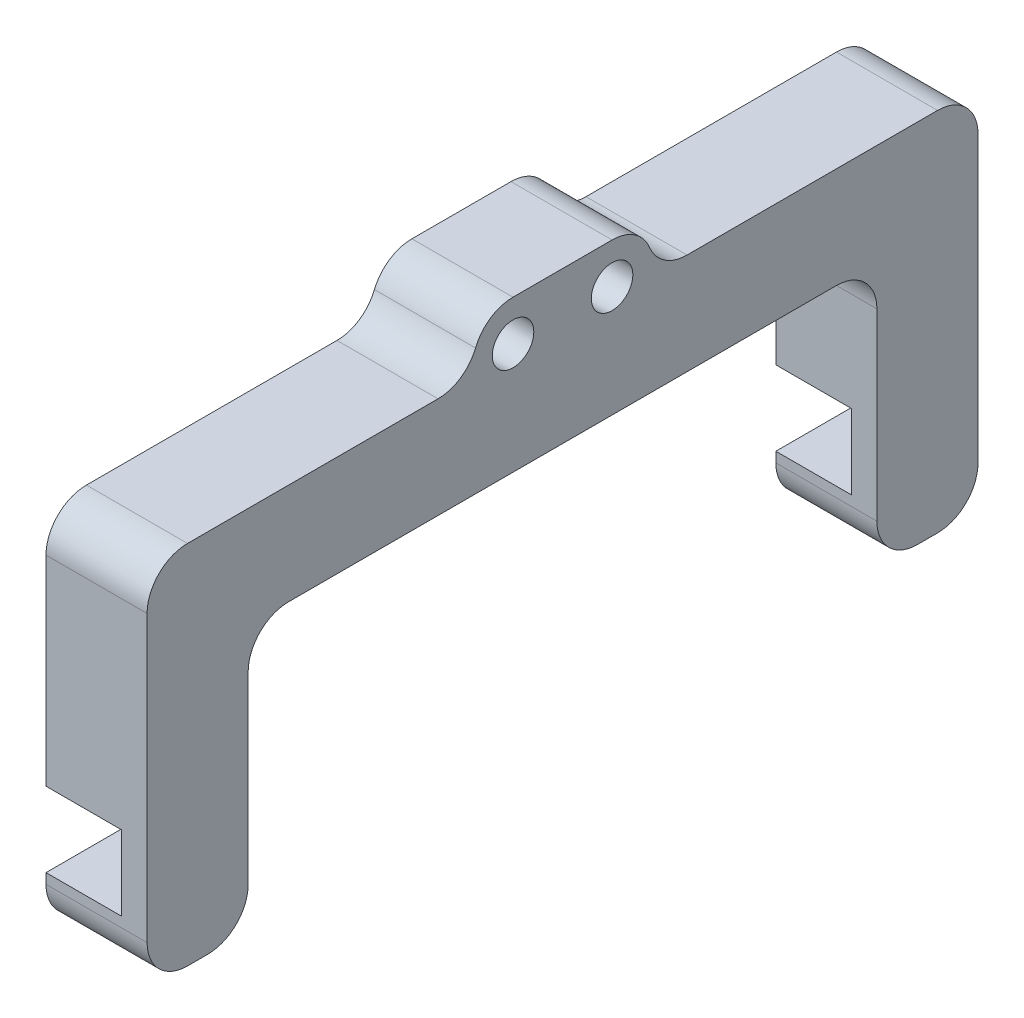
ISO-10303-21;
HEADER;
FILE_DESCRIPTION(('STEP AP214'),'2;1');
FILE_NAME('part.step','',(''),(''),'','','');
FILE_SCHEMA(('AUTOMOTIVE_DESIGN { 1 0 10303 214 1 1 1 1 }'));
ENDSEC;
DATA;
#1=APPLICATION_CONTEXT('core data for automotive mechanical design processes');
#2=APPLICATION_PROTOCOL_DEFINITION('international standard','automotive_design',2000,#1);
#3=PRODUCT_CONTEXT('',#1,'mechanical');
#4=PRODUCT('Part','Part','',(#3));
#5=PRODUCT_RELATED_PRODUCT_CATEGORY('part','',(#4));
#6=PRODUCT_DEFINITION_FORMATION('','',#4);
#7=PRODUCT_DEFINITION_CONTEXT('part definition',#1,'design');
#8=PRODUCT_DEFINITION('design','',#6,#7);
#9=PRODUCT_DEFINITION_SHAPE('','',#8);
#10=(LENGTH_UNIT() NAMED_UNIT(*) SI_UNIT(.MILLI.,.METRE.));
#11=(NAMED_UNIT(*) PLANE_ANGLE_UNIT() SI_UNIT($,.RADIAN.));
#12=(NAMED_UNIT(*) SI_UNIT($,.STERADIAN.) SOLID_ANGLE_UNIT());
#13=UNCERTAINTY_MEASURE_WITH_UNIT(LENGTH_MEASURE(1.E-05),#10,'distance_accuracy_value','');
#14=(GEOMETRIC_REPRESENTATION_CONTEXT(3) GLOBAL_UNCERTAINTY_ASSIGNED_CONTEXT((#13)) GLOBAL_UNIT_ASSIGNED_CONTEXT((#10,
#11,#12)) REPRESENTATION_CONTEXT('',''));
#15=CARTESIAN_POINT('',(0.,0.,0.));
#16=DIRECTION('',(0.,0.,1.));
#17=DIRECTION('',(1.,0.,0.));
#18=AXIS2_PLACEMENT_3D('',#15,#16,#17);
#19=CARTESIAN_POINT('',(-17.0423003142182,-28.8,-40.));
#20=DIRECTION('',(0.,-1.,0.));
#21=DIRECTION('',(0.,0.,-1.));
#22=AXIS2_PLACEMENT_3D('',#19,#20,#21);
#23=PLANE('',#22);
#24=DIRECTION('',(1.,0.,0.));
#25=VECTOR('',#24,1.);
#26=CARTESIAN_POINT('',(-17.0423003142182,-28.8,-50.));
#27=LINE('',#26,#25);
#28=CARTESIAN_POINT('',(0.,-28.8,-50.));
#29=VERTEX_POINT('',#28);
#30=CARTESIAN_POINT('',(7.47106781,-28.8,-50.));
#31=VERTEX_POINT('',#30);
#32=EDGE_CURVE('E335',#29,#31,#27,.T.);
#33=ORIENTED_EDGE('',*,*,#32,.T.);
#34=DIRECTION('',(0.,0.,-1.));
#35=VECTOR('',#34,1.);
#36=CARTESIAN_POINT('',(7.47106781,-28.8,-50.));
#37=LINE('',#36,#35);
#38=CARTESIAN_POINT('',(7.47106781,-28.8,-40.));
#39=VERTEX_POINT('',#38);
#40=EDGE_CURVE('E277',#39,#31,#37,.T.);
#41=ORIENTED_EDGE('',*,*,#40,.F.);
#42=DIRECTION('',(1.,0.,0.));
#43=VECTOR('',#42,1.);
#44=CARTESIAN_POINT('',(-17.0423003142182,-28.8,-40.));
#45=LINE('',#44,#43);
#46=CARTESIAN_POINT('',(0.,-28.8,-40.));
#47=VERTEX_POINT('',#46);
#48=EDGE_CURVE('E339',#47,#39,#45,.T.);
#49=ORIENTED_EDGE('',*,*,#48,.F.);
#50=DIRECTION('',(0.,0.,-1.));
#51=VECTOR('',#50,1.);
#52=CARTESIAN_POINT('',(0.,-28.8,-40.));
#53=LINE('',#52,#51);
#54=EDGE_CURVE('E331',#47,#29,#53,.T.);
#55=ORIENTED_EDGE('',*,*,#54,.T.);
#56=EDGE_LOOP('',(#33,#41,#49,#55));
#57=FACE_BOUND('',#56,.T.);
#58=ADVANCED_FACE('F38',(#57),#23,.T.);
#59=CARTESIAN_POINT('',(-17.0423003142182,-28.8,32.2));
#60=DIRECTION('',(0.,-1.,0.));
#61=DIRECTION('',(0.,0.,-1.));
#62=AXIS2_PLACEMENT_3D('',#59,#60,#61);
#63=PLANE('',#62);
#64=DIRECTION('',(1.,0.,0.));
#65=VECTOR('',#64,1.);
#66=CARTESIAN_POINT('',(-17.0423003142182,-28.8,22.2));
#67=LINE('',#66,#65);
#68=CARTESIAN_POINT('',(0.,-28.8,22.2));
#69=VERTEX_POINT('',#68);
#70=CARTESIAN_POINT('',(7.47106781,-28.8,22.2));
#71=VERTEX_POINT('',#70);
#72=EDGE_CURVE('E353',#69,#71,#67,.T.);
#73=ORIENTED_EDGE('',*,*,#72,.T.);
#74=DIRECTION('',(0.,0.,1.));
#75=VECTOR('',#74,1.);
#76=CARTESIAN_POINT('',(7.47106781,-28.8,32.2));
#77=LINE('',#76,#75);
#78=CARTESIAN_POINT('',(7.47106781,-28.8,32.2));
#79=VERTEX_POINT('',#78);
#80=EDGE_CURVE('E324',#71,#79,#77,.T.);
#81=ORIENTED_EDGE('',*,*,#80,.T.);
#82=DIRECTION('',(1.,0.,0.));
#83=VECTOR('',#82,1.);
#84=CARTESIAN_POINT('',(-17.0423003142182,-28.8,32.2));
#85=LINE('',#84,#83);
#86=CARTESIAN_POINT('',(0.,-28.8,32.2));
#87=VERTEX_POINT('',#86);
#88=EDGE_CURVE('E358',#87,#79,#85,.T.);
#89=ORIENTED_EDGE('',*,*,#88,.F.);
#90=DIRECTION('',(0.,0.,-1.));
#91=VECTOR('',#90,1.);
#92=CARTESIAN_POINT('',(0.,-28.8,32.2));
#93=LINE('',#92,#91);
#94=EDGE_CURVE('E349',#87,#69,#93,.T.);
#95=ORIENTED_EDGE('',*,*,#94,.T.);
#96=EDGE_LOOP('',(#73,#81,#89,#95));
#97=FACE_BOUND('',#96,.T.);
#98=ADVANCED_FACE('F635',(#97),#63,.T.);
#99=CARTESIAN_POINT('',(10.,-15.,32.2));
#100=DIRECTION('',(0.,1.,0.));
#101=DIRECTION('',(0.,0.,1.));
#102=AXIS2_PLACEMENT_3D('',#99,#100,#101);
#103=PLANE('',#102);
#104=DIRECTION('',(0.,0.,-1.));
#105=VECTOR('',#104,1.);
#106=CARTESIAN_POINT('',(0.,-15.,32.2));
#107=LINE('',#106,#105);
#108=CARTESIAN_POINT('',(0.,-15.,18.2));
#109=VERTEX_POINT('',#108);
#110=CARTESIAN_POINT('',(0.,-15.,-36.));
#111=VERTEX_POINT('',#110);
#112=EDGE_CURVE('E411',#109,#111,#107,.T.);
#113=ORIENTED_EDGE('',*,*,#112,.T.);
#114=DIRECTION('',(1.,0.,0.));
#115=VECTOR('',#114,1.);
#116=CARTESIAN_POINT('',(10.,-15.,-36.));
#117=LINE('',#116,#115);
#118=CARTESIAN_POINT('',(10.,-15.,-36.));
#119=VERTEX_POINT('',#118);
#120=EDGE_CURVE('E490',#111,#119,#117,.T.);
#121=ORIENTED_EDGE('',*,*,#120,.T.);
#122=DIRECTION('',(0.,0.,-1.));
#123=VECTOR('',#122,1.);
#124=CARTESIAN_POINT('',(10.,-15.,32.2));
#125=LINE('',#124,#123);
#126=CARTESIAN_POINT('',(10.,-15.,18.2));
#127=VERTEX_POINT('',#126);
#128=EDGE_CURVE('E389',#127,#119,#125,.T.);
#129=ORIENTED_EDGE('',*,*,#128,.F.);
#130=DIRECTION('',(1.,0.,0.));
#131=VECTOR('',#130,1.);
#132=CARTESIAN_POINT('',(10.,-15.,18.2));
#133=LINE('',#132,#131);
#134=EDGE_CURVE('E487',#127,#109,#133,.F.);
#135=ORIENTED_EDGE('',*,*,#134,.T.);
#136=EDGE_LOOP('',(#113,#121,#129,#135));
#137=FACE_BOUND('',#136,.T.);
#138=ADVANCED_FACE('F590',(#137),#103,.F.);
#139=CARTESIAN_POINT('',(10.,-5.,0.));
#140=DIRECTION('',(0.,-1.,0.));
#141=DIRECTION('',(0.,0.,-1.));
#142=AXIS2_PLACEMENT_3D('',#139,#140,#141);
#143=PLANE('',#142);
#144=DIRECTION('',(0.,0.,1.));
#145=VECTOR('',#144,1.);
#146=CARTESIAN_POINT('',(10.,-5.,0.));
#147=LINE('',#146,#145);
#148=CARTESIAN_POINT('',(10.,-5.,3.41619848709566));
#149=VERTEX_POINT('',#148);
#150=CARTESIAN_POINT('',(10.,-5.,28.2));
#151=VERTEX_POINT('',#150);
#152=EDGE_CURVE('E381',#149,#151,#147,.T.);
#153=ORIENTED_EDGE('',*,*,#152,.F.);
#154=DIRECTION('',(-1.,0.,0.));
#155=VECTOR('',#154,1.);
#156=CARTESIAN_POINT('',(10.,-5.,3.41619848709566));
#157=LINE('',#156,#155);
#158=CARTESIAN_POINT('',(0.,-5.,3.41619848709566));
#159=VERTEX_POINT('',#158);
#160=EDGE_CURVE('E556',#149,#159,#157,.T.);
#161=ORIENTED_EDGE('',*,*,#160,.T.);
#162=DIRECTION('',(0.,0.,1.));
#163=VECTOR('',#162,1.);
#164=CARTESIAN_POINT('',(0.,-5.,0.));
#165=LINE('',#164,#163);
#166=CARTESIAN_POINT('',(0.,-5.,28.2));
#167=VERTEX_POINT('',#166);
#168=EDGE_CURVE('E369',#159,#167,#165,.T.);
#169=ORIENTED_EDGE('',*,*,#168,.T.);
#170=DIRECTION('',(-1.,0.,0.));
#171=VECTOR('',#170,1.);
#172=CARTESIAN_POINT('',(10.,-5.,28.2));
#173=LINE('',#172,#171);
#174=EDGE_CURVE('E533',#167,#151,#173,.F.);
#175=ORIENTED_EDGE('',*,*,#174,.T.);
#176=EDGE_LOOP('',(#153,#161,#169,#175));
#177=FACE_BOUND('',#176,.T.);
#178=ADVANCED_FACE('F694',(#177),#143,.F.);
#179=CARTESIAN_POINT('',(10.,-5.,32.2));
#180=DIRECTION('',(0.,0.,-1.));
#181=DIRECTION('',(-1.,0.,0.));
#182=AXIS2_PLACEMENT_3D('',#179,#180,#181);
#183=PLANE('',#182);
#184=DIRECTION('',(0.,-1.,0.));
#185=VECTOR('',#184,1.);
#186=CARTESIAN_POINT('',(0.,-36.2,32.2));
#187=LINE('',#186,#185);
#188=CARTESIAN_POINT('',(0.,-36.2,32.2));
#189=VERTEX_POINT('',#188);
#190=CARTESIAN_POINT('',(0.,-37.2,32.2));
#191=VERTEX_POINT('',#190);
#192=EDGE_CURVE('E294',#189,#191,#187,.T.);
#193=ORIENTED_EDGE('',*,*,#192,.T.);
#194=DIRECTION('',(1.,0.,0.));
#195=VECTOR('',#194,1.);
#196=CARTESIAN_POINT('',(10.,-37.2,32.2));
#197=LINE('',#196,#195);
#198=CARTESIAN_POINT('',(10.,-37.2,32.2));
#199=VERTEX_POINT('',#198);
#200=EDGE_CURVE('E518',#191,#199,#197,.T.);
#201=ORIENTED_EDGE('',*,*,#200,.T.);
#202=DIRECTION('',(0.,-1.,0.));
#203=VECTOR('',#202,1.);
#204=CARTESIAN_POINT('',(10.,-5.,32.2));
#205=LINE('',#204,#203);
#206=CARTESIAN_POINT('',(10.,-9.00000000000001,32.2));
#207=VERTEX_POINT('',#206);
#208=EDGE_CURVE('E384',#207,#199,#205,.T.);
#209=ORIENTED_EDGE('',*,*,#208,.F.);
#210=DIRECTION('',(-1.,0.,0.));
#211=VECTOR('',#210,1.);
#212=CARTESIAN_POINT('',(10.,-9.00000000000001,32.2));
#213=LINE('',#212,#211);
#214=CARTESIAN_POINT('',(0.,-9.00000000000001,32.2));
#215=VERTEX_POINT('',#214);
#216=EDGE_CURVE('E514',#207,#215,#213,.T.);
#217=ORIENTED_EDGE('',*,*,#216,.T.);
#218=DIRECTION('',(0.,-1.,0.));
#219=VECTOR('',#218,1.);
#220=CARTESIAN_POINT('',(0.,-5.,32.2));
#221=LINE('',#220,#219);
#222=EDGE_CURVE('E408',#215,#87,#221,.T.);
#223=ORIENTED_EDGE('',*,*,#222,.T.);
#224=ORIENTED_EDGE('',*,*,#88,.T.);
#225=DIRECTION('',(0.,-1.,0.));
#226=VECTOR('',#225,1.);
#227=CARTESIAN_POINT('',(7.47106781,-28.8,32.2));
#228=LINE('',#227,#226);
#229=CARTESIAN_POINT('',(7.47106781,-36.2,32.2));
#230=VERTEX_POINT('',#229);
#231=EDGE_CURVE('E298',#79,#230,#228,.T.);
#232=ORIENTED_EDGE('',*,*,#231,.T.);
#233=DIRECTION('',(1.,0.,0.));
#234=VECTOR('',#233,1.);
#235=CARTESIAN_POINT('',(-11.1803398874989,-36.2,32.2));
#236=LINE('',#235,#234);
#237=EDGE_CURVE('E299',#189,#230,#236,.T.);
#238=ORIENTED_EDGE('',*,*,#237,.F.);
#239=EDGE_LOOP('',(#193,#201,#209,#217,#223,#224,#232,#238));
#240=FACE_BOUND('',#239,.T.);
#241=ADVANCED_FACE('F623',(#240),#183,.F.);
#242=CARTESIAN_POINT('',(10.,-15.,-50.));
#243=DIRECTION('',(0.,0.,1.));
#244=DIRECTION('',(1.,0.,0.));
#245=AXIS2_PLACEMENT_3D('',#242,#243,#244);
#246=PLANE('',#245);
#247=DIRECTION('',(0.,1.,0.));
#248=VECTOR('',#247,1.);
#249=CARTESIAN_POINT('',(10.,-15.,-50.));
#250=LINE('',#249,#248);
#251=CARTESIAN_POINT('',(10.,-37.2,-50.));
#252=VERTEX_POINT('',#251);
#253=CARTESIAN_POINT('',(10.,-9.,-50.));
#254=VERTEX_POINT('',#253);
#255=EDGE_CURVE('E393',#252,#254,#250,.T.);
#256=ORIENTED_EDGE('',*,*,#255,.F.);
#257=DIRECTION('',(1.,0.,0.));
#258=VECTOR('',#257,1.);
#259=CARTESIAN_POINT('',(10.,-37.2,-50.));
#260=LINE('',#259,#258);
#261=CARTESIAN_POINT('',(0.,-37.2,-50.));
#262=VERTEX_POINT('',#261);
#263=EDGE_CURVE('E473',#252,#262,#260,.F.);
#264=ORIENTED_EDGE('',*,*,#263,.T.);
#265=DIRECTION('',(0.,-1.,0.));
#266=VECTOR('',#265,1.);
#267=CARTESIAN_POINT('',(0.,-36.2,-50.));
#268=LINE('',#267,#266);
#269=CARTESIAN_POINT('',(0.,-36.2,-50.));
#270=VERTEX_POINT('',#269);
#271=EDGE_CURVE('E266',#270,#262,#268,.T.);
#272=ORIENTED_EDGE('',*,*,#271,.F.);
#273=DIRECTION('',(1.,0.,0.));
#274=VECTOR('',#273,1.);
#275=CARTESIAN_POINT('',(-11.1803398874989,-36.2,-50.));
#276=LINE('',#275,#274);
#277=CARTESIAN_POINT('',(7.47106781,-36.2,-50.));
#278=VERTEX_POINT('',#277);
#279=EDGE_CURVE('E263',#270,#278,#276,.T.);
#280=ORIENTED_EDGE('',*,*,#279,.T.);
#281=DIRECTION('',(0.,-1.,0.));
#282=VECTOR('',#281,1.);
#283=CARTESIAN_POINT('',(7.47106781,-28.8,-50.));
#284=LINE('',#283,#282);
#285=EDGE_CURVE('E248',#31,#278,#284,.T.);
#286=ORIENTED_EDGE('',*,*,#285,.F.);
#287=ORIENTED_EDGE('',*,*,#32,.F.);
#288=DIRECTION('',(0.,1.,0.));
#289=VECTOR('',#288,1.);
#290=CARTESIAN_POINT('',(0.,-15.,-50.));
#291=LINE('',#290,#289);
#292=CARTESIAN_POINT('',(0.,-9.,-50.));
#293=VERTEX_POINT('',#292);
#294=EDGE_CURVE('E415',#29,#293,#291,.T.);
#295=ORIENTED_EDGE('',*,*,#294,.T.);
#296=DIRECTION('',(-1.,0.,0.));
#297=VECTOR('',#296,1.);
#298=CARTESIAN_POINT('',(10.,-9.,-50.));
#299=LINE('',#298,#297);
#300=EDGE_CURVE('E470',#293,#254,#299,.F.);
#301=ORIENTED_EDGE('',*,*,#300,.T.);
#302=EDGE_LOOP('',(#256,#264,#272,#280,#286,#287,#295,#301));
#303=FACE_BOUND('',#302,.T.);
#304=ADVANCED_FACE('F687',(#303),#246,.F.);
#305=CARTESIAN_POINT('',(10.,-5.,-17.8));
#306=DIRECTION('',(0.,-1.,0.));
#307=DIRECTION('',(0.,0.,-1.));
#308=AXIS2_PLACEMENT_3D('',#305,#306,#307);
#309=PLANE('',#308);
#310=DIRECTION('',(0.,0.,1.));
#311=VECTOR('',#310,1.);
#312=CARTESIAN_POINT('',(0.,-5.,-17.8));
#313=LINE('',#312,#311);
#314=CARTESIAN_POINT('',(0.,-5.,-46.));
#315=VERTEX_POINT('',#314);
#316=CARTESIAN_POINT('',(0.,-5.,-21.2161984870957));
#317=VERTEX_POINT('',#316);
#318=EDGE_CURVE('E419',#315,#317,#313,.T.);
#319=ORIENTED_EDGE('',*,*,#318,.T.);
#320=DIRECTION('',(-1.,0.,0.));
#321=VECTOR('',#320,1.);
#322=CARTESIAN_POINT('',(10.,-5.,-21.2161984870957));
#323=LINE('',#322,#321);
#324=CARTESIAN_POINT('',(10.,-5.,-21.2161984870957));
#325=VERTEX_POINT('',#324);
#326=EDGE_CURVE('E553',#317,#325,#323,.F.);
#327=ORIENTED_EDGE('',*,*,#326,.T.);
#328=DIRECTION('',(0.,0.,1.));
#329=VECTOR('',#328,1.);
#330=CARTESIAN_POINT('',(10.,-5.,-17.8));
#331=LINE('',#330,#329);
#332=CARTESIAN_POINT('',(10.,-5.,-46.));
#333=VERTEX_POINT('',#332);
#334=EDGE_CURVE('E397',#333,#325,#331,.T.);
#335=ORIENTED_EDGE('',*,*,#334,.F.);
#336=DIRECTION('',(-1.,0.,0.));
#337=VECTOR('',#336,1.);
#338=CARTESIAN_POINT('',(10.,-5.,-46.));
#339=LINE('',#338,#337);
#340=EDGE_CURVE('E522',#333,#315,#339,.T.);
#341=ORIENTED_EDGE('',*,*,#340,.T.);
#342=EDGE_LOOP('',(#319,#327,#335,#341));
#343=FACE_BOUND('',#342,.T.);
#344=ADVANCED_FACE('F683',(#343),#309,.F.);
#345=CARTESIAN_POINT('',(10.,0.,0.));
#346=DIRECTION('',(0.,-1.,0.));
#347=DIRECTION('',(0.,0.,-1.));
#348=AXIS2_PLACEMENT_3D('',#345,#346,#347);
#349=PLANE('',#348);
#350=DIRECTION('',(0.,0.,1.));
#351=VECTOR('',#350,1.);
#352=CARTESIAN_POINT('',(10.,0.,0.));
#353=LINE('',#352,#351);
#354=CARTESIAN_POINT('',(10.,0.,-13.8));
#355=VERTEX_POINT('',#354);
#356=CARTESIAN_POINT('',(10.,0.,-4.));
#357=VERTEX_POINT('',#356);
#358=EDGE_CURVE('E401',#355,#357,#353,.T.);
#359=ORIENTED_EDGE('',*,*,#358,.F.);
#360=DIRECTION('',(-1.,0.,0.));
#361=VECTOR('',#360,1.);
#362=CARTESIAN_POINT('',(10.,0.,-13.8));
#363=LINE('',#362,#361);
#364=CARTESIAN_POINT('',(0.,0.,-13.8));
#365=VERTEX_POINT('',#364);
#366=EDGE_CURVE('E428',#355,#365,#363,.T.);
#367=ORIENTED_EDGE('',*,*,#366,.T.);
#368=DIRECTION('',(0.,0.,1.));
#369=VECTOR('',#368,1.);
#370=CARTESIAN_POINT('',(0.,0.,0.));
#371=LINE('',#370,#369);
#372=CARTESIAN_POINT('',(0.,0.,-4.));
#373=VERTEX_POINT('',#372);
#374=EDGE_CURVE('E385',#365,#373,#371,.T.);
#375=ORIENTED_EDGE('',*,*,#374,.T.);
#376=DIRECTION('',(-1.,0.,0.));
#377=VECTOR('',#376,1.);
#378=CARTESIAN_POINT('',(10.,0.,-4.));
#379=LINE('',#378,#377);
#380=EDGE_CURVE('E405',#373,#357,#379,.F.);
#381=ORIENTED_EDGE('',*,*,#380,.T.);
#382=EDGE_LOOP('',(#359,#367,#375,#381));
#383=FACE_BOUND('',#382,.T.);
#384=ADVANCED_FACE('F676',(#383),#349,.F.);
#385=CARTESIAN_POINT('',(10.,0.,0.));
#386=DIRECTION('',(-1.,0.,0.));
#387=DIRECTION('',(0.,0.,1.));
#388=AXIS2_PLACEMENT_3D('',#385,#386,#387);
#389=PLANE('',#388);
#390=CARTESIAN_POINT('',(10.,-4.,-4.));
#391=DIRECTION('',(1.,0.,0.));
#392=DIRECTION('',(0.,0.,-1.));
#393=AXIS2_PLACEMENT_3D('',#390,#391,#392);
#394=CIRCLE('',#393,2.055);
#395=CARTESIAN_POINT('',(10.,-4.,-6.055));
#396=VERTEX_POINT('',#395);
#397=EDGE_CURVE('E370',#396,#396,#394,.T.);
#398=ORIENTED_EDGE('',*,*,#397,.F.);
#399=EDGE_LOOP('',(#398));
#400=FACE_BOUND('',#399,.T.);
#401=CARTESIAN_POINT('',(10.,-4.,-13.8));
#402=DIRECTION('',(1.,0.,0.));
#403=DIRECTION('',(0.,0.,-1.));
#404=AXIS2_PLACEMENT_3D('',#401,#402,#403);
#405=CIRCLE('',#404,2.055);
#406=CARTESIAN_POINT('',(10.,-4.,-15.855));
#407=VERTEX_POINT('',#406);
#408=EDGE_CURVE('E364',#407,#407,#405,.T.);
#409=ORIENTED_EDGE('',*,*,#408,.F.);
#410=EDGE_LOOP('',(#409));
#411=FACE_BOUND('',#410,.T.);
#412=DIRECTION('',(0.,0.,1.));
#413=VECTOR('',#412,1.);
#414=CARTESIAN_POINT('',(10.,-41.2,-50.));
#415=LINE('',#414,#413);
#416=CARTESIAN_POINT('',(10.,-41.2,-46.));
#417=VERTEX_POINT('',#416);
#418=CARTESIAN_POINT('',(10.,-41.2,-44.));
#419=VERTEX_POINT('',#418);
#420=EDGE_CURVE('E259',#417,#419,#415,.T.);
#421=ORIENTED_EDGE('',*,*,#420,.F.);
#422=CARTESIAN_POINT('',(10.,-37.2,-46.));
#423=DIRECTION('',(-1.,0.,0.));
#424=DIRECTION('',(0.,0.,1.));
#425=AXIS2_PLACEMENT_3D('',#422,#423,#424);
#426=CIRCLE('',#425,4.);
#427=EDGE_CURVE('E467',#417,#252,#426,.F.);
#428=ORIENTED_EDGE('',*,*,#427,.T.);
#429=ORIENTED_EDGE('',*,*,#255,.T.);
#430=CARTESIAN_POINT('',(10.,-9.,-46.));
#431=DIRECTION('',(-1.,0.,0.));
#432=DIRECTION('',(0.,0.,1.));
#433=AXIS2_PLACEMENT_3D('',#430,#431,#432);
#434=CIRCLE('',#433,4.);
#435=EDGE_CURVE('E455',#254,#333,#434,.F.);
#436=ORIENTED_EDGE('',*,*,#435,.T.);
#437=ORIENTED_EDGE('',*,*,#334,.T.);
#438=CARTESIAN_POINT('',(10.,-1.,-21.2161984870957));
#439=DIRECTION('',(-1.,0.,0.));
#440=DIRECTION('',(0.,0.,1.));
#441=AXIS2_PLACEMENT_3D('',#438,#439,#440);
#442=CIRCLE('',#441,4.);
#443=CARTESIAN_POINT('',(10.,-2.5,-17.5080992435478));
#444=VERTEX_POINT('',#443);
#445=EDGE_CURVE('E565',#325,#444,#442,.T.);
#446=ORIENTED_EDGE('',*,*,#445,.T.);
#447=CARTESIAN_POINT('',(10.,-4.,-13.8));
#448=DIRECTION('',(-1.,0.,0.));
#449=DIRECTION('',(0.,0.,1.));
#450=AXIS2_PLACEMENT_3D('',#447,#448,#449);
#451=CIRCLE('',#450,4.);
#452=EDGE_CURVE('E442',#444,#355,#451,.F.);
#453=ORIENTED_EDGE('',*,*,#452,.T.);
#454=ORIENTED_EDGE('',*,*,#358,.T.);
#455=CARTESIAN_POINT('',(10.,-4.,-4.));
#456=DIRECTION('',(-1.,0.,0.));
#457=DIRECTION('',(0.,0.,1.));
#458=AXIS2_PLACEMENT_3D('',#455,#456,#457);
#459=CIRCLE('',#458,4.);
#460=CARTESIAN_POINT('',(10.,-2.5,-0.291900756452169));
#461=VERTEX_POINT('',#460);
#462=EDGE_CURVE('E439',#357,#461,#459,.F.);
#463=ORIENTED_EDGE('',*,*,#462,.T.);
#464=CARTESIAN_POINT('',(10.,-1.,3.41619848709566));
#465=DIRECTION('',(-1.,0.,0.));
#466=DIRECTION('',(0.,0.,1.));
#467=AXIS2_PLACEMENT_3D('',#464,#465,#466);
#468=CIRCLE('',#467,4.);
#469=EDGE_CURVE('E11',#461,#149,#468,.T.);
#470=ORIENTED_EDGE('',*,*,#469,.T.);
#471=ORIENTED_EDGE('',*,*,#152,.T.);
#472=CARTESIAN_POINT('',(10.,-9.00000000000001,28.2));
#473=DIRECTION('',(-1.,0.,0.));
#474=DIRECTION('',(0.,0.,1.));
#475=AXIS2_PLACEMENT_3D('',#472,#473,#474);
#476=CIRCLE('',#475,4.);
#477=EDGE_CURVE('E452',#151,#207,#476,.F.);
#478=ORIENTED_EDGE('',*,*,#477,.T.);
#479=ORIENTED_EDGE('',*,*,#208,.T.);
#480=CARTESIAN_POINT('',(10.,-37.2,28.2));
#481=DIRECTION('',(-1.,0.,0.));
#482=DIRECTION('',(0.,0.,1.));
#483=AXIS2_PLACEMENT_3D('',#480,#481,#482);
#484=CIRCLE('',#483,4.);
#485=CARTESIAN_POINT('',(10.,-41.2,28.2));
#486=VERTEX_POINT('',#485);
#487=EDGE_CURVE('E458',#199,#486,#484,.F.);
#488=ORIENTED_EDGE('',*,*,#487,.T.);
#489=DIRECTION('',(0.,0.,-1.));
#490=VECTOR('',#489,1.);
#491=CARTESIAN_POINT('',(10.,-41.2,32.2));
#492=LINE('',#491,#490);
#493=CARTESIAN_POINT('',(10.,-41.2,26.2));
#494=VERTEX_POINT('',#493);
#495=EDGE_CURVE('E285',#486,#494,#492,.T.);
#496=ORIENTED_EDGE('',*,*,#495,.T.);
#497=CARTESIAN_POINT('',(10.,-37.2,26.2));
#498=DIRECTION('',(-1.,0.,0.));
#499=DIRECTION('',(0.,0.,1.));
#500=AXIS2_PLACEMENT_3D('',#497,#498,#499);
#501=CIRCLE('',#500,4.);
#502=CARTESIAN_POINT('',(10.,-37.2,22.2));
#503=VERTEX_POINT('',#502);
#504=EDGE_CURVE('E461',#494,#503,#501,.F.);
#505=ORIENTED_EDGE('',*,*,#504,.T.);
#506=DIRECTION('',(0.,1.,0.));
#507=VECTOR('',#506,1.);
#508=CARTESIAN_POINT('',(10.,-15.,22.2));
#509=LINE('',#508,#507);
#510=CARTESIAN_POINT('',(10.,-19.,22.2));
#511=VERTEX_POINT('',#510);
#512=EDGE_CURVE('E345',#503,#511,#509,.T.);
#513=ORIENTED_EDGE('',*,*,#512,.T.);
#514=CARTESIAN_POINT('',(10.,-19.,18.2));
#515=DIRECTION('',(-1.,0.,0.));
#516=DIRECTION('',(0.,0.,1.));
#517=AXIS2_PLACEMENT_3D('',#514,#515,#516);
#518=CIRCLE('',#517,4.);
#519=EDGE_CURVE('E543',#511,#127,#518,.T.);
#520=ORIENTED_EDGE('',*,*,#519,.T.);
#521=ORIENTED_EDGE('',*,*,#128,.T.);
#522=CARTESIAN_POINT('',(10.,-19.,-36.));
#523=DIRECTION('',(-1.,0.,0.));
#524=DIRECTION('',(0.,0.,1.));
#525=AXIS2_PLACEMENT_3D('',#522,#523,#524);
#526=CIRCLE('',#525,4.);
#527=CARTESIAN_POINT('',(10.,-19.,-40.));
#528=VERTEX_POINT('',#527);
#529=EDGE_CURVE('E537',#119,#528,#526,.T.);
#530=ORIENTED_EDGE('',*,*,#529,.T.);
#531=DIRECTION('',(0.,-1.,0.));
#532=VECTOR('',#531,1.);
#533=CARTESIAN_POINT('',(10.,-15.,-40.));
#534=LINE('',#533,#532);
#535=CARTESIAN_POINT('',(10.,-37.2,-40.));
#536=VERTEX_POINT('',#535);
#537=EDGE_CURVE('E327',#528,#536,#534,.T.);
#538=ORIENTED_EDGE('',*,*,#537,.T.);
#539=CARTESIAN_POINT('',(10.,-37.2,-44.));
#540=DIRECTION('',(-1.,0.,0.));
#541=DIRECTION('',(0.,0.,1.));
#542=AXIS2_PLACEMENT_3D('',#539,#540,#541);
#543=CIRCLE('',#542,4.);
#544=EDGE_CURVE('E464',#536,#419,#543,.F.);
#545=ORIENTED_EDGE('',*,*,#544,.T.);
#546=EDGE_LOOP('',(#421,#428,#429,#436,#437,#446,#453,#454,#463,#470,#471,#478,#479,#488,#496,
#505,#513,#520,#521,#530,#538,#545));
#547=FACE_BOUND('',#546,.T.);
#548=ADVANCED_FACE('F583',(#400,#411,#547),#389,.F.);
#549=CARTESIAN_POINT('',(0.,0.,0.));
#550=DIRECTION('',(-1.,0.,0.));
#551=DIRECTION('',(0.,0.,1.));
#552=AXIS2_PLACEMENT_3D('',#549,#550,#551);
#553=PLANE('',#552);
#554=CARTESIAN_POINT('',(0.,-4.,-4.));
#555=DIRECTION('',(1.,0.,0.));
#556=DIRECTION('',(0.,0.,-1.));
#557=AXIS2_PLACEMENT_3D('',#554,#555,#556);
#558=CIRCLE('',#557,2.055);
#559=CARTESIAN_POINT('',(0.,-4.,-6.055));
#560=VERTEX_POINT('',#559);
#561=EDGE_CURVE('E365',#560,#560,#558,.T.);
#562=ORIENTED_EDGE('',*,*,#561,.T.);
#563=EDGE_LOOP('',(#562));
#564=FACE_BOUND('',#563,.T.);
#565=CARTESIAN_POINT('',(0.,-4.,-13.8));
#566=DIRECTION('',(1.,0.,0.));
#567=DIRECTION('',(0.,0.,-1.));
#568=AXIS2_PLACEMENT_3D('',#565,#566,#567);
#569=CIRCLE('',#568,2.055);
#570=CARTESIAN_POINT('',(0.,-4.,-15.855));
#571=VERTEX_POINT('',#570);
#572=EDGE_CURVE('E374',#571,#571,#569,.T.);
#573=ORIENTED_EDGE('',*,*,#572,.T.);
#574=EDGE_LOOP('',(#573));
#575=FACE_BOUND('',#574,.T.);
#576=ORIENTED_EDGE('',*,*,#318,.F.);
#577=CARTESIAN_POINT('',(0.,-9.,-46.));
#578=DIRECTION('',(-1.,0.,0.));
#579=DIRECTION('',(0.,0.,1.));
#580=AXIS2_PLACEMENT_3D('',#577,#578,#579);
#581=CIRCLE('',#580,4.);
#582=EDGE_CURVE('E530',#315,#293,#581,.T.);
#583=ORIENTED_EDGE('',*,*,#582,.T.);
#584=ORIENTED_EDGE('',*,*,#294,.F.);
#585=ORIENTED_EDGE('',*,*,#54,.F.);
#586=DIRECTION('',(0.,-1.,0.));
#587=VECTOR('',#586,1.);
#588=CARTESIAN_POINT('',(0.,-15.,-40.));
#589=LINE('',#588,#587);
#590=CARTESIAN_POINT('',(0.,-19.,-40.));
#591=VERTEX_POINT('',#590);
#592=EDGE_CURVE('E336',#591,#47,#589,.T.);
#593=ORIENTED_EDGE('',*,*,#592,.F.);
#594=CARTESIAN_POINT('',(0.,-19.,-36.));
#595=DIRECTION('',(-1.,0.,0.));
#596=DIRECTION('',(0.,0.,1.));
#597=AXIS2_PLACEMENT_3D('',#594,#595,#596);
#598=CIRCLE('',#597,4.);
#599=EDGE_CURVE('E540',#591,#111,#598,.F.);
#600=ORIENTED_EDGE('',*,*,#599,.T.);
#601=ORIENTED_EDGE('',*,*,#112,.F.);
#602=CARTESIAN_POINT('',(0.,-19.,18.2));
#603=DIRECTION('',(-1.,0.,0.));
#604=DIRECTION('',(0.,0.,1.));
#605=AXIS2_PLACEMENT_3D('',#602,#603,#604);
#606=CIRCLE('',#605,4.);
#607=CARTESIAN_POINT('',(0.,-19.,22.2));
#608=VERTEX_POINT('',#607);
#609=EDGE_CURVE('E546',#109,#608,#606,.F.);
#610=ORIENTED_EDGE('',*,*,#609,.T.);
#611=DIRECTION('',(0.,1.,0.));
#612=VECTOR('',#611,1.);
#613=CARTESIAN_POINT('',(0.,-15.,22.2));
#614=LINE('',#613,#612);
#615=EDGE_CURVE('E354',#69,#608,#614,.T.);
#616=ORIENTED_EDGE('',*,*,#615,.F.);
#617=ORIENTED_EDGE('',*,*,#94,.F.);
#618=ORIENTED_EDGE('',*,*,#222,.F.);
#619=CARTESIAN_POINT('',(0.,-9.00000000000001,28.2));
#620=DIRECTION('',(-1.,0.,0.));
#621=DIRECTION('',(0.,0.,1.));
#622=AXIS2_PLACEMENT_3D('',#619,#620,#621);
#623=CIRCLE('',#622,4.);
#624=EDGE_CURVE('E526',#215,#167,#623,.T.);
#625=ORIENTED_EDGE('',*,*,#624,.T.);
#626=ORIENTED_EDGE('',*,*,#168,.F.);
#627=CARTESIAN_POINT('',(0.,-1.,3.41619848709566));
#628=DIRECTION('',(-1.,0.,0.));
#629=DIRECTION('',(0.,0.,1.));
#630=AXIS2_PLACEMENT_3D('',#627,#628,#629);
#631=CIRCLE('',#630,4.);
#632=CARTESIAN_POINT('',(0.,-2.5,-0.291900756452169));
#633=VERTEX_POINT('',#632);
#634=EDGE_CURVE('E47',#159,#633,#631,.F.);
#635=ORIENTED_EDGE('',*,*,#634,.T.);
#636=CARTESIAN_POINT('',(0.,-4.,-4.));
#637=DIRECTION('',(-1.,0.,0.));
#638=DIRECTION('',(0.,0.,1.));
#639=AXIS2_PLACEMENT_3D('',#636,#637,#638);
#640=CIRCLE('',#639,4.);
#641=EDGE_CURVE('E432',#633,#373,#640,.T.);
#642=ORIENTED_EDGE('',*,*,#641,.T.);
#643=ORIENTED_EDGE('',*,*,#374,.F.);
#644=CARTESIAN_POINT('',(0.,-4.,-13.8));
#645=DIRECTION('',(-1.,0.,0.));
#646=DIRECTION('',(0.,0.,1.));
#647=AXIS2_PLACEMENT_3D('',#644,#645,#646);
#648=CIRCLE('',#647,4.);
#649=CARTESIAN_POINT('',(0.,-2.5,-17.5080992435478));
#650=VERTEX_POINT('',#649);
#651=EDGE_CURVE('E435',#365,#650,#648,.T.);
#652=ORIENTED_EDGE('',*,*,#651,.T.);
#653=CARTESIAN_POINT('',(0.,-1.,-21.2161984870957));
#654=DIRECTION('',(-1.,0.,0.));
#655=DIRECTION('',(0.,0.,1.));
#656=AXIS2_PLACEMENT_3D('',#653,#654,#655);
#657=CIRCLE('',#656,4.);
#658=EDGE_CURVE('E562',#650,#317,#657,.F.);
#659=ORIENTED_EDGE('',*,*,#658,.T.);
#660=EDGE_LOOP('',(#576,#583,#584,#585,#593,#600,#601,#610,#616,#617,#618,#625,#626,#635,#642,
#643,#652,#659));
#661=FACE_BOUND('',#660,.T.);
#662=ADVANCED_FACE('F595',(#564,#575,#661),#553,.T.);
#663=CARTESIAN_POINT('',(0.,-4.,-13.8));
#664=DIRECTION('',(1.,0.,0.));
#665=DIRECTION('',(0.,0.,-1.));
#666=AXIS2_PLACEMENT_3D('',#663,#664,#665);
#667=CYLINDRICAL_SURFACE('',#666,2.055);
#668=ORIENTED_EDGE('',*,*,#572,.F.);
#669=EDGE_LOOP('',(#668));
#670=FACE_BOUND('',#669,.T.);
#671=ORIENTED_EDGE('',*,*,#408,.T.);
#672=EDGE_LOOP('',(#671));
#673=FACE_BOUND('',#672,.T.);
#674=ADVANCED_FACE('F669',(#670,#673),#667,.F.);
#675=CARTESIAN_POINT('',(0.,-4.,-4.));
#676=DIRECTION('',(1.,0.,0.));
#677=DIRECTION('',(0.,0.,-1.));
#678=AXIS2_PLACEMENT_3D('',#675,#676,#677);
#679=CYLINDRICAL_SURFACE('',#678,2.055);
#680=ORIENTED_EDGE('',*,*,#561,.F.);
#681=EDGE_LOOP('',(#680));
#682=FACE_BOUND('',#681,.T.);
#683=ORIENTED_EDGE('',*,*,#397,.T.);
#684=EDGE_LOOP('',(#683));
#685=FACE_BOUND('',#684,.T.);
#686=ADVANCED_FACE('F665',(#682,#685),#679,.F.);
#687=CARTESIAN_POINT('',(-17.0423003142182,-15.,22.2));
#688=DIRECTION('',(0.,0.,-1.));
#689=DIRECTION('',(-1.,0.,0.));
#690=AXIS2_PLACEMENT_3D('',#687,#688,#689);
#691=PLANE('',#690);
#692=ORIENTED_EDGE('',*,*,#615,.T.);
#693=DIRECTION('',(1.,0.,0.));
#694=VECTOR('',#693,1.);
#695=CARTESIAN_POINT('',(-17.0423003142182,-19.,22.2));
#696=LINE('',#695,#694);
#697=EDGE_CURVE('E497',#608,#511,#696,.T.);
#698=ORIENTED_EDGE('',*,*,#697,.T.);
#699=ORIENTED_EDGE('',*,*,#512,.F.);
#700=DIRECTION('',(1.,0.,0.));
#701=VECTOR('',#700,1.);
#702=CARTESIAN_POINT('',(-17.0423003142182,-37.2,22.2));
#703=LINE('',#702,#701);
#704=CARTESIAN_POINT('',(0.,-37.2,22.2));
#705=VERTEX_POINT('',#704);
#706=EDGE_CURVE('E494',#503,#705,#703,.F.);
#707=ORIENTED_EDGE('',*,*,#706,.T.);
#708=DIRECTION('',(0.,1.,0.));
#709=VECTOR('',#708,1.);
#710=CARTESIAN_POINT('',(0.,-36.2,22.2));
#711=LINE('',#710,#709);
#712=CARTESIAN_POINT('',(0.,-36.2,22.2));
#713=VERTEX_POINT('',#712);
#714=EDGE_CURVE('E293',#705,#713,#711,.T.);
#715=ORIENTED_EDGE('',*,*,#714,.T.);
#716=DIRECTION('',(1.,0.,0.));
#717=VECTOR('',#716,1.);
#718=CARTESIAN_POINT('',(-11.1803398874989,-36.2,22.2));
#719=LINE('',#718,#717);
#720=CARTESIAN_POINT('',(7.47106781,-36.2,22.2));
#721=VERTEX_POINT('',#720);
#722=EDGE_CURVE('E304',#713,#721,#719,.T.);
#723=ORIENTED_EDGE('',*,*,#722,.T.);
#724=DIRECTION('',(0.,1.,0.));
#725=VECTOR('',#724,1.);
#726=CARTESIAN_POINT('',(7.47106781,-28.8,22.2));
#727=LINE('',#726,#725);
#728=EDGE_CURVE('E320',#721,#71,#727,.T.);
#729=ORIENTED_EDGE('',*,*,#728,.T.);
#730=ORIENTED_EDGE('',*,*,#72,.F.);
#731=EDGE_LOOP('',(#692,#698,#699,#707,#715,#723,#729,#730));
#732=FACE_BOUND('',#731,.T.);
#733=ADVANCED_FACE('F602',(#732),#691,.T.);
#734=CARTESIAN_POINT('',(-17.0423003142182,-15.,-40.));
#735=DIRECTION('',(0.,0.,1.));
#736=DIRECTION('',(0.,-1.,0.));
#737=AXIS2_PLACEMENT_3D('',#734,#735,#736);
#738=PLANE('',#737);
#739=DIRECTION('',(0.,1.,0.));
#740=VECTOR('',#739,1.);
#741=CARTESIAN_POINT('',(0.,-36.2,-40.));
#742=LINE('',#741,#740);
#743=CARTESIAN_POINT('',(0.,-37.2,-40.));
#744=VERTEX_POINT('',#743);
#745=CARTESIAN_POINT('',(0.,-36.2,-40.));
#746=VERTEX_POINT('',#745);
#747=EDGE_CURVE('E235',#744,#746,#742,.T.);
#748=ORIENTED_EDGE('',*,*,#747,.F.);
#749=DIRECTION('',(1.,0.,0.));
#750=VECTOR('',#749,1.);
#751=CARTESIAN_POINT('',(10.,-37.2,-40.));
#752=LINE('',#751,#750);
#753=EDGE_CURVE('E484',#744,#536,#752,.T.);
#754=ORIENTED_EDGE('',*,*,#753,.T.);
#755=ORIENTED_EDGE('',*,*,#537,.F.);
#756=DIRECTION('',(1.,0.,0.));
#757=VECTOR('',#756,1.);
#758=CARTESIAN_POINT('',(-17.0423003142182,-19.,-40.));
#759=LINE('',#758,#757);
#760=EDGE_CURVE('E481',#528,#591,#759,.F.);
#761=ORIENTED_EDGE('',*,*,#760,.T.);
#762=ORIENTED_EDGE('',*,*,#592,.T.);
#763=ORIENTED_EDGE('',*,*,#48,.T.);
#764=DIRECTION('',(0.,1.,0.));
#765=VECTOR('',#764,1.);
#766=CARTESIAN_POINT('',(7.47106781,-28.8,-40.));
#767=LINE('',#766,#765);
#768=CARTESIAN_POINT('',(7.47106781,-36.2,-40.));
#769=VERTEX_POINT('',#768);
#770=EDGE_CURVE('E255',#769,#39,#767,.T.);
#771=ORIENTED_EDGE('',*,*,#770,.F.);
#772=DIRECTION('',(1.,0.,0.));
#773=VECTOR('',#772,1.);
#774=CARTESIAN_POINT('',(-11.1803398874989,-36.2,-40.));
#775=LINE('',#774,#773);
#776=EDGE_CURVE('E252',#746,#769,#775,.T.);
#777=ORIENTED_EDGE('',*,*,#776,.F.);
#778=EDGE_LOOP('',(#748,#754,#755,#761,#762,#763,#771,#777));
#779=FACE_BOUND('',#778,.T.);
#780=ADVANCED_FACE('F253',(#779),#738,.T.);
#781=CARTESIAN_POINT('',(7.47106781,0.,0.));
#782=DIRECTION('',(1.,0.,0.));
#783=DIRECTION('',(0.,0.,-1.));
#784=AXIS2_PLACEMENT_3D('',#781,#782,#783);
#785=PLANE('',#784);
#786=ORIENTED_EDGE('',*,*,#231,.F.);
#787=ORIENTED_EDGE('',*,*,#80,.F.);
#788=ORIENTED_EDGE('',*,*,#728,.F.);
#789=DIRECTION('',(0.,0.,-1.));
#790=VECTOR('',#789,1.);
#791=CARTESIAN_POINT('',(7.47106781,-36.2,32.2));
#792=LINE('',#791,#790);
#793=EDGE_CURVE('E316',#230,#721,#792,.T.);
#794=ORIENTED_EDGE('',*,*,#793,.F.);
#795=EDGE_LOOP('',(#786,#787,#788,#794));
#796=FACE_BOUND('',#795,.T.);
#797=ADVANCED_FACE('F639',(#796),#785,.F.);
#798=CARTESIAN_POINT('',(0.,0.,0.));
#799=DIRECTION('',(-1.,0.,0.));
#800=DIRECTION('',(0.,0.,1.));
#801=AXIS2_PLACEMENT_3D('',#798,#799,#800);
#802=PLANE('',#801);
#803=ORIENTED_EDGE('',*,*,#714,.F.);
#804=CARTESIAN_POINT('',(0.,-37.2,26.2));
#805=DIRECTION('',(-1.,0.,0.));
#806=DIRECTION('',(0.,0.,1.));
#807=AXIS2_PLACEMENT_3D('',#804,#805,#806);
#808=CIRCLE('',#807,4.);
#809=CARTESIAN_POINT('',(0.,-41.2,26.2));
#810=VERTEX_POINT('',#809);
#811=EDGE_CURVE('E511',#705,#810,#808,.T.);
#812=ORIENTED_EDGE('',*,*,#811,.T.);
#813=DIRECTION('',(0.,0.,-1.));
#814=VECTOR('',#813,1.);
#815=CARTESIAN_POINT('',(0.,-41.2,32.2));
#816=LINE('',#815,#814);
#817=CARTESIAN_POINT('',(0.,-41.2,28.2));
#818=VERTEX_POINT('',#817);
#819=EDGE_CURVE('E289',#818,#810,#816,.T.);
#820=ORIENTED_EDGE('',*,*,#819,.F.);
#821=CARTESIAN_POINT('',(0.,-37.2,28.2));
#822=DIRECTION('',(-1.,0.,0.));
#823=DIRECTION('',(0.,0.,1.));
#824=AXIS2_PLACEMENT_3D('',#821,#822,#823);
#825=CIRCLE('',#824,4.);
#826=EDGE_CURVE('E508',#818,#191,#825,.T.);
#827=ORIENTED_EDGE('',*,*,#826,.T.);
#828=ORIENTED_EDGE('',*,*,#192,.F.);
#829=DIRECTION('',(0.,0.,1.));
#830=VECTOR('',#829,1.);
#831=CARTESIAN_POINT('',(0.,-36.2,32.2));
#832=LINE('',#831,#830);
#833=EDGE_CURVE('E300',#713,#189,#832,.T.);
#834=ORIENTED_EDGE('',*,*,#833,.F.);
#835=EDGE_LOOP('',(#803,#812,#820,#827,#828,#834));
#836=FACE_BOUND('',#835,.T.);
#837=ADVANCED_FACE('F617',(#836),#802,.T.);
#838=CARTESIAN_POINT('',(-11.1803398874989,-41.2,32.2));
#839=DIRECTION('',(0.,-1.,0.));
#840=DIRECTION('',(0.,0.,-1.));
#841=AXIS2_PLACEMENT_3D('',#838,#839,#840);
#842=PLANE('',#841);
#843=ORIENTED_EDGE('',*,*,#819,.T.);
#844=DIRECTION('',(1.,0.,0.));
#845=VECTOR('',#844,1.);
#846=CARTESIAN_POINT('',(-11.1803398874989,-41.2,26.2));
#847=LINE('',#846,#845);
#848=EDGE_CURVE('E504',#810,#494,#847,.T.);
#849=ORIENTED_EDGE('',*,*,#848,.T.);
#850=ORIENTED_EDGE('',*,*,#495,.F.);
#851=DIRECTION('',(1.,0.,0.));
#852=VECTOR('',#851,1.);
#853=CARTESIAN_POINT('',(0.,-41.2,28.2));
#854=LINE('',#853,#852);
#855=EDGE_CURVE('E501',#486,#818,#854,.F.);
#856=ORIENTED_EDGE('',*,*,#855,.T.);
#857=EDGE_LOOP('',(#843,#849,#850,#856));
#858=FACE_BOUND('',#857,.T.);
#859=ADVANCED_FACE('F611',(#858),#842,.T.);
#860=CARTESIAN_POINT('',(-11.1803398874989,-36.2,32.2));
#861=DIRECTION('',(0.,1.,0.));
#862=DIRECTION('',(0.,0.,1.));
#863=AXIS2_PLACEMENT_3D('',#860,#861,#862);
#864=PLANE('',#863);
#865=ORIENTED_EDGE('',*,*,#237,.T.);
#866=ORIENTED_EDGE('',*,*,#793,.T.);
#867=ORIENTED_EDGE('',*,*,#722,.F.);
#868=ORIENTED_EDGE('',*,*,#833,.T.);
#869=EDGE_LOOP('',(#865,#866,#867,#868));
#870=FACE_BOUND('',#869,.T.);
#871=ADVANCED_FACE('F642',(#870),#864,.T.);
#872=CARTESIAN_POINT('',(7.47106781,0.,-17.8));
#873=DIRECTION('',(1.,0.,0.));
#874=DIRECTION('',(0.,0.,1.));
#875=AXIS2_PLACEMENT_3D('',#872,#873,#874);
#876=PLANE('',#875);
#877=ORIENTED_EDGE('',*,*,#285,.T.);
#878=DIRECTION('',(0.,0.,1.));
#879=VECTOR('',#878,1.);
#880=CARTESIAN_POINT('',(7.47106781,-36.2,-50.));
#881=LINE('',#880,#879);
#882=EDGE_CURVE('E282',#278,#769,#881,.T.);
#883=ORIENTED_EDGE('',*,*,#882,.T.);
#884=ORIENTED_EDGE('',*,*,#770,.T.);
#885=ORIENTED_EDGE('',*,*,#40,.T.);
#886=EDGE_LOOP('',(#877,#883,#884,#885));
#887=FACE_BOUND('',#886,.T.);
#888=ADVANCED_FACE('F645',(#887),#876,.F.);
#889=CARTESIAN_POINT('',(-11.1803398874989,-36.2,-50.));
#890=DIRECTION('',(0.,-1.,0.));
#891=DIRECTION('',(0.,0.,-1.));
#892=AXIS2_PLACEMENT_3D('',#889,#890,#891);
#893=PLANE('',#892);
#894=ORIENTED_EDGE('',*,*,#776,.T.);
#895=ORIENTED_EDGE('',*,*,#882,.F.);
#896=ORIENTED_EDGE('',*,*,#279,.F.);
#897=DIRECTION('',(0.,0.,-1.));
#898=VECTOR('',#897,1.);
#899=CARTESIAN_POINT('',(0.,-36.2,-50.));
#900=LINE('',#899,#898);
#901=EDGE_CURVE('E240',#746,#270,#900,.T.);
#902=ORIENTED_EDGE('',*,*,#901,.F.);
#903=EDGE_LOOP('',(#894,#895,#896,#902));
#904=FACE_BOUND('',#903,.T.);
#905=ADVANCED_FACE('F261',(#904),#893,.F.);
#906=CARTESIAN_POINT('',(-11.1803398874989,-41.2,-50.));
#907=DIRECTION('',(0.,1.,0.));
#908=DIRECTION('',(0.,0.,1.));
#909=AXIS2_PLACEMENT_3D('',#906,#907,#908);
#910=PLANE('',#909);
#911=DIRECTION('',(0.,0.,1.));
#912=VECTOR('',#911,1.);
#913=CARTESIAN_POINT('',(0.,-41.2,-50.));
#914=LINE('',#913,#912);
#915=CARTESIAN_POINT('',(0.,-41.2,-46.));
#916=VERTEX_POINT('',#915);
#917=CARTESIAN_POINT('',(0.,-41.2,-44.));
#918=VERTEX_POINT('',#917);
#919=EDGE_CURVE('E249',#916,#918,#914,.T.);
#920=ORIENTED_EDGE('',*,*,#919,.F.);
#921=DIRECTION('',(1.,0.,0.));
#922=VECTOR('',#921,1.);
#923=CARTESIAN_POINT('',(-11.1803398874989,-41.2,-46.));
#924=LINE('',#923,#922);
#925=EDGE_CURVE('E448',#916,#417,#924,.T.);
#926=ORIENTED_EDGE('',*,*,#925,.T.);
#927=ORIENTED_EDGE('',*,*,#420,.T.);
#928=DIRECTION('',(1.,0.,0.));
#929=VECTOR('',#928,1.);
#930=CARTESIAN_POINT('',(0.,-41.2,-44.));
#931=LINE('',#930,#929);
#932=EDGE_CURVE('E445',#419,#918,#931,.F.);
#933=ORIENTED_EDGE('',*,*,#932,.T.);
#934=EDGE_LOOP('',(#920,#926,#927,#933));
#935=FACE_BOUND('',#934,.T.);
#936=ADVANCED_FACE('F576',(#935),#910,.F.);
#937=CARTESIAN_POINT('',(0.,0.,0.));
#938=DIRECTION('',(-1.,0.,0.));
#939=DIRECTION('',(0.,0.,1.));
#940=AXIS2_PLACEMENT_3D('',#937,#938,#939);
#941=PLANE('',#940);
#942=ORIENTED_EDGE('',*,*,#271,.T.);
#943=CARTESIAN_POINT('',(0.,-37.2,-46.));
#944=DIRECTION('',(-1.,0.,0.));
#945=DIRECTION('',(0.,0.,1.));
#946=AXIS2_PLACEMENT_3D('',#943,#944,#945);
#947=CIRCLE('',#946,4.);
#948=EDGE_CURVE('E478',#262,#916,#947,.T.);
#949=ORIENTED_EDGE('',*,*,#948,.T.);
#950=ORIENTED_EDGE('',*,*,#919,.T.);
#951=CARTESIAN_POINT('',(0.,-37.2,-44.));
#952=DIRECTION('',(-1.,0.,0.));
#953=DIRECTION('',(0.,0.,1.));
#954=AXIS2_PLACEMENT_3D('',#951,#952,#953);
#955=CIRCLE('',#954,4.);
#956=EDGE_CURVE('E243',#918,#744,#955,.T.);
#957=ORIENTED_EDGE('',*,*,#956,.T.);
#958=ORIENTED_EDGE('',*,*,#747,.T.);
#959=ORIENTED_EDGE('',*,*,#901,.T.);
#960=EDGE_LOOP('',(#942,#949,#950,#957,#958,#959));
#961=FACE_BOUND('',#960,.T.);
#962=ADVANCED_FACE('F238',(#961),#941,.T.);
#963=CARTESIAN_POINT('',(10.,-4.,-13.8));
#964=DIRECTION('',(-1.,0.,0.));
#965=DIRECTION('',(0.,0.,1.));
#966=AXIS2_PLACEMENT_3D('',#963,#964,#965);
#967=CYLINDRICAL_SURFACE('',#966,4.);
#968=ORIENTED_EDGE('',*,*,#452,.F.);
#969=DIRECTION('',(-1.,0.,0.));
#970=VECTOR('',#969,1.);
#971=CARTESIAN_POINT('',(10.,-2.5,-17.5080992435478));
#972=LINE('',#971,#970);
#973=EDGE_CURVE('E549',#444,#650,#972,.T.);
#974=ORIENTED_EDGE('',*,*,#973,.T.);
#975=ORIENTED_EDGE('',*,*,#651,.F.);
#976=ORIENTED_EDGE('',*,*,#366,.F.);
#977=EDGE_LOOP('',(#968,#974,#975,#976));
#978=FACE_BOUND('',#977,.T.);
#979=ADVANCED_FACE('F700',(#978),#967,.T.);
#980=CARTESIAN_POINT('',(10.,-4.,-4.));
#981=DIRECTION('',(-1.,0.,0.));
#982=DIRECTION('',(0.,0.,1.));
#983=AXIS2_PLACEMENT_3D('',#980,#981,#982);
#984=CYLINDRICAL_SURFACE('',#983,4.);
#985=ORIENTED_EDGE('',*,*,#641,.F.);
#986=DIRECTION('',(-1.,0.,0.));
#987=VECTOR('',#986,1.);
#988=CARTESIAN_POINT('',(10.,-2.5,-0.291900756452169));
#989=LINE('',#988,#987);
#990=EDGE_CURVE('E60',#633,#461,#989,.F.);
#991=ORIENTED_EDGE('',*,*,#990,.T.);
#992=ORIENTED_EDGE('',*,*,#462,.F.);
#993=ORIENTED_EDGE('',*,*,#380,.F.);
#994=EDGE_LOOP('',(#985,#991,#992,#993));
#995=FACE_BOUND('',#994,.T.);
#996=ADVANCED_FACE('F703',(#995),#984,.T.);
#997=CARTESIAN_POINT('',(-11.1803398874989,-37.2,-46.));
#998=DIRECTION('',(1.,0.,0.));
#999=DIRECTION('',(0.,0.,-1.));
#1000=AXIS2_PLACEMENT_3D('',#997,#998,#999);
#1001=CYLINDRICAL_SURFACE('',#1000,4.);
#1002=ORIENTED_EDGE('',*,*,#948,.F.);
#1003=ORIENTED_EDGE('',*,*,#263,.F.);
#1004=ORIENTED_EDGE('',*,*,#427,.F.);
#1005=ORIENTED_EDGE('',*,*,#925,.F.);
#1006=EDGE_LOOP('',(#1002,#1003,#1004,#1005));
#1007=FACE_BOUND('',#1006,.T.);
#1008=ADVANCED_FACE('F707',(#1007),#1001,.T.);
#1009=CARTESIAN_POINT('',(-17.0423003142182,-37.2,-44.));
#1010=DIRECTION('',(-1.,0.,0.));
#1011=DIRECTION('',(0.,0.,1.));
#1012=AXIS2_PLACEMENT_3D('',#1009,#1010,#1011);
#1013=CYLINDRICAL_SURFACE('',#1012,4.);
#1014=ORIENTED_EDGE('',*,*,#956,.F.);
#1015=ORIENTED_EDGE('',*,*,#932,.F.);
#1016=ORIENTED_EDGE('',*,*,#544,.F.);
#1017=ORIENTED_EDGE('',*,*,#753,.F.);
#1018=EDGE_LOOP('',(#1014,#1015,#1016,#1017));
#1019=FACE_BOUND('',#1018,.T.);
#1020=ADVANCED_FACE('F580',(#1019),#1013,.T.);
#1021=CARTESIAN_POINT('',(10.,-19.,-36.));
#1022=DIRECTION('',(1.,0.,0.));
#1023=DIRECTION('',(0.,0.,-1.));
#1024=AXIS2_PLACEMENT_3D('',#1021,#1022,#1023);
#1025=CYLINDRICAL_SURFACE('',#1024,4.);
#1026=ORIENTED_EDGE('',*,*,#599,.F.);
#1027=ORIENTED_EDGE('',*,*,#760,.F.);
#1028=ORIENTED_EDGE('',*,*,#529,.F.);
#1029=ORIENTED_EDGE('',*,*,#120,.F.);
#1030=EDGE_LOOP('',(#1026,#1027,#1028,#1029));
#1031=FACE_BOUND('',#1030,.T.);
#1032=ADVANCED_FACE('F588',(#1031),#1025,.F.);
#1033=CARTESIAN_POINT('',(-17.0423003142182,-19.,18.2));
#1034=DIRECTION('',(1.,0.,0.));
#1035=DIRECTION('',(0.,0.,-1.));
#1036=AXIS2_PLACEMENT_3D('',#1033,#1034,#1035);
#1037=CYLINDRICAL_SURFACE('',#1036,4.);
#1038=ORIENTED_EDGE('',*,*,#609,.F.);
#1039=ORIENTED_EDGE('',*,*,#134,.F.);
#1040=ORIENTED_EDGE('',*,*,#519,.F.);
#1041=ORIENTED_EDGE('',*,*,#697,.F.);
#1042=EDGE_LOOP('',(#1038,#1039,#1040,#1041));
#1043=FACE_BOUND('',#1042,.T.);
#1044=ADVANCED_FACE('F599',(#1043),#1037,.F.);
#1045=CARTESIAN_POINT('',(-11.1803398874989,-37.2,26.2));
#1046=DIRECTION('',(1.,0.,0.));
#1047=DIRECTION('',(0.,0.,-1.));
#1048=AXIS2_PLACEMENT_3D('',#1045,#1046,#1047);
#1049=CYLINDRICAL_SURFACE('',#1048,4.);
#1050=ORIENTED_EDGE('',*,*,#811,.F.);
#1051=ORIENTED_EDGE('',*,*,#706,.F.);
#1052=ORIENTED_EDGE('',*,*,#504,.F.);
#1053=ORIENTED_EDGE('',*,*,#848,.F.);
#1054=EDGE_LOOP('',(#1050,#1051,#1052,#1053));
#1055=FACE_BOUND('',#1054,.T.);
#1056=ADVANCED_FACE('F609',(#1055),#1049,.T.);
#1057=CARTESIAN_POINT('',(10.,-37.2,28.2));
#1058=DIRECTION('',(-1.,0.,0.));
#1059=DIRECTION('',(0.,0.,1.));
#1060=AXIS2_PLACEMENT_3D('',#1057,#1058,#1059);
#1061=CYLINDRICAL_SURFACE('',#1060,4.);
#1062=ORIENTED_EDGE('',*,*,#826,.F.);
#1063=ORIENTED_EDGE('',*,*,#855,.F.);
#1064=ORIENTED_EDGE('',*,*,#487,.F.);
#1065=ORIENTED_EDGE('',*,*,#200,.F.);
#1066=EDGE_LOOP('',(#1062,#1063,#1064,#1065));
#1067=FACE_BOUND('',#1066,.T.);
#1068=ADVANCED_FACE('F620',(#1067),#1061,.T.);
#1069=CARTESIAN_POINT('',(10.,-9.,-46.));
#1070=DIRECTION('',(-1.,0.,0.));
#1071=DIRECTION('',(0.,0.,1.));
#1072=AXIS2_PLACEMENT_3D('',#1069,#1070,#1071);
#1073=CYLINDRICAL_SURFACE('',#1072,4.);
#1074=ORIENTED_EDGE('',*,*,#435,.F.);
#1075=ORIENTED_EDGE('',*,*,#300,.F.);
#1076=ORIENTED_EDGE('',*,*,#582,.F.);
#1077=ORIENTED_EDGE('',*,*,#340,.F.);
#1078=EDGE_LOOP('',(#1074,#1075,#1076,#1077));
#1079=FACE_BOUND('',#1078,.T.);
#1080=ADVANCED_FACE('F721',(#1079),#1073,.T.);
#1081=CARTESIAN_POINT('',(10.,-9.00000000000001,28.2));
#1082=DIRECTION('',(-1.,0.,0.));
#1083=DIRECTION('',(0.,0.,1.));
#1084=AXIS2_PLACEMENT_3D('',#1081,#1082,#1083);
#1085=CYLINDRICAL_SURFACE('',#1084,4.);
#1086=ORIENTED_EDGE('',*,*,#477,.F.);
#1087=ORIENTED_EDGE('',*,*,#174,.F.);
#1088=ORIENTED_EDGE('',*,*,#624,.F.);
#1089=ORIENTED_EDGE('',*,*,#216,.F.);
#1090=EDGE_LOOP('',(#1086,#1087,#1088,#1089));
#1091=FACE_BOUND('',#1090,.T.);
#1092=ADVANCED_FACE('F630',(#1091),#1085,.T.);
#1093=CARTESIAN_POINT('',(10.,-1.,-21.2161984870957));
#1094=DIRECTION('',(-1.,0.,0.));
#1095=DIRECTION('',(0.,0.,1.));
#1096=AXIS2_PLACEMENT_3D('',#1093,#1094,#1095);
#1097=CYLINDRICAL_SURFACE('',#1096,4.);
#1098=ORIENTED_EDGE('',*,*,#445,.F.);
#1099=ORIENTED_EDGE('',*,*,#326,.F.);
#1100=ORIENTED_EDGE('',*,*,#658,.F.);
#1101=ORIENTED_EDGE('',*,*,#973,.F.);
#1102=EDGE_LOOP('',(#1098,#1099,#1100,#1101));
#1103=FACE_BOUND('',#1102,.T.);
#1104=ADVANCED_FACE('F726',(#1103),#1097,.F.);
#1105=CARTESIAN_POINT('',(10.,-1.,3.41619848709566));
#1106=DIRECTION('',(-1.,0.,0.));
#1107=DIRECTION('',(0.,0.,1.));
#1108=AXIS2_PLACEMENT_3D('',#1105,#1106,#1107);
#1109=CYLINDRICAL_SURFACE('',#1108,4.);
#1110=ORIENTED_EDGE('',*,*,#469,.F.);
#1111=ORIENTED_EDGE('',*,*,#990,.F.);
#1112=ORIENTED_EDGE('',*,*,#634,.F.);
#1113=ORIENTED_EDGE('',*,*,#160,.F.);
#1114=EDGE_LOOP('',(#1110,#1111,#1112,#1113));
#1115=FACE_BOUND('',#1114,.T.);
#1116=ADVANCED_FACE('F40',(#1115),#1109,.F.);
#1117=CLOSED_SHELL('',(#58,#98,#138,#178,#241,#304,#344,#384,#548,#662,#674,#686,#733,#780,#797,
#837,#859,#871,#888,#905,#936,#962,#979,#996,#1008,#1020,#1032,#1044,#1056,#1068,#1080,#1092,
#1104,#1116));
#1118=MANIFOLD_SOLID_BREP('B2',#1117);
#1119=ADVANCED_BREP_SHAPE_REPRESENTATION('',(#18,#1118),#14);
#1120=SHAPE_DEFINITION_REPRESENTATION(#9,#1119);
ENDSEC;
END-ISO-10303-21;
